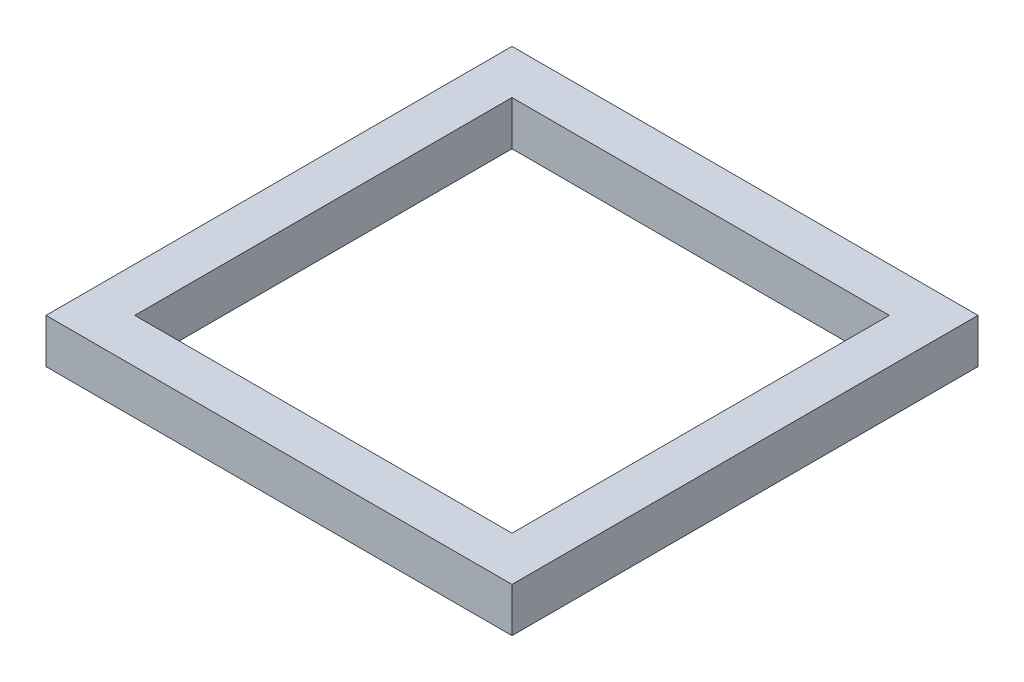
ISO-10303-21;
HEADER;
FILE_DESCRIPTION(('STEP AP214'),'2;1');
FILE_NAME('part.step','',(''),(''),'','','');
FILE_SCHEMA(('AUTOMOTIVE_DESIGN { 1 0 10303 214 1 1 1 1 }'));
ENDSEC;
DATA;
#1=APPLICATION_CONTEXT('core data for automotive mechanical design processes');
#2=APPLICATION_PROTOCOL_DEFINITION('international standard','automotive_design',2000,#1);
#3=PRODUCT_CONTEXT('',#1,'mechanical');
#4=PRODUCT('Part','Part','',(#3));
#5=PRODUCT_RELATED_PRODUCT_CATEGORY('part','',(#4));
#6=PRODUCT_DEFINITION_FORMATION('','',#4);
#7=PRODUCT_DEFINITION_CONTEXT('part definition',#1,'design');
#8=PRODUCT_DEFINITION('design','',#6,#7);
#9=PRODUCT_DEFINITION_SHAPE('','',#8);
#10=(LENGTH_UNIT() NAMED_UNIT(*) SI_UNIT(.MILLI.,.METRE.));
#11=(NAMED_UNIT(*) PLANE_ANGLE_UNIT() SI_UNIT($,.RADIAN.));
#12=(NAMED_UNIT(*) SI_UNIT($,.STERADIAN.) SOLID_ANGLE_UNIT());
#13=UNCERTAINTY_MEASURE_WITH_UNIT(LENGTH_MEASURE(1.E-05),#10,'distance_accuracy_value','');
#14=(GEOMETRIC_REPRESENTATION_CONTEXT(3) GLOBAL_UNCERTAINTY_ASSIGNED_CONTEXT((#13)) GLOBAL_UNIT_ASSIGNED_CONTEXT((#10,
#11,#12)) REPRESENTATION_CONTEXT('',''));
#15=CARTESIAN_POINT('',(0.,0.,0.));
#16=DIRECTION('',(0.,0.,1.));
#17=DIRECTION('',(1.,0.,0.));
#18=AXIS2_PLACEMENT_3D('',#15,#16,#17);
#19=CARTESIAN_POINT('',(0.,1.,0.));
#20=DIRECTION('',(1.,0.,0.));
#21=DIRECTION('',(0.,0.,-1.));
#22=AXIS2_PLACEMENT_3D('',#19,#20,#21);
#23=PLANE('',#22);
#24=DIRECTION('',(0.,0.,1.));
#25=VECTOR('',#24,1.);
#26=CARTESIAN_POINT('',(0.,0.,0.));
#27=LINE('',#26,#25);
#28=CARTESIAN_POINT('',(0.,0.,-10.5));
#29=VERTEX_POINT('',#28);
#30=CARTESIAN_POINT('',(0.,0.,0.));
#31=VERTEX_POINT('',#30);
#32=EDGE_CURVE('E147',#29,#31,#27,.T.);
#33=ORIENTED_EDGE('',*,*,#32,.T.);
#34=DIRECTION('',(0.,-1.,0.));
#35=VECTOR('',#34,1.);
#36=CARTESIAN_POINT('',(0.,1.,0.));
#37=LINE('',#36,#35);
#38=CARTESIAN_POINT('',(0.,1.,0.));
#39=VERTEX_POINT('',#38);
#40=EDGE_CURVE('E11',#39,#31,#37,.T.);
#41=ORIENTED_EDGE('',*,*,#40,.F.);
#42=DIRECTION('',(0.,0.,1.));
#43=VECTOR('',#42,1.);
#44=CARTESIAN_POINT('',(0.,1.,0.));
#45=LINE('',#44,#43);
#46=CARTESIAN_POINT('',(0.,1.,-10.5));
#47=VERTEX_POINT('',#46);
#48=EDGE_CURVE('E153',#47,#39,#45,.T.);
#49=ORIENTED_EDGE('',*,*,#48,.F.);
#50=DIRECTION('',(0.,-1.,0.));
#51=VECTOR('',#50,1.);
#52=CARTESIAN_POINT('',(0.,1.,-10.5));
#53=LINE('',#52,#51);
#54=EDGE_CURVE('E167',#47,#29,#53,.T.);
#55=ORIENTED_EDGE('',*,*,#54,.T.);
#56=EDGE_LOOP('',(#33,#41,#49,#55));
#57=FACE_BOUND('',#56,.T.);
#58=ADVANCED_FACE('F39',(#57),#23,.F.);
#59=CARTESIAN_POINT('',(0.,1.,0.));
#60=DIRECTION('',(0.,0.,-1.));
#61=DIRECTION('',(-1.,0.,0.));
#62=AXIS2_PLACEMENT_3D('',#59,#60,#61);
#63=PLANE('',#62);
#64=DIRECTION('',(1.,0.,0.));
#65=VECTOR('',#64,1.);
#66=CARTESIAN_POINT('',(0.,0.,0.));
#67=LINE('',#66,#65);
#68=CARTESIAN_POINT('',(10.5,0.,0.));
#69=VERTEX_POINT('',#68);
#70=EDGE_CURVE('E171',#31,#69,#67,.T.);
#71=ORIENTED_EDGE('',*,*,#70,.T.);
#72=DIRECTION('',(0.,-1.,0.));
#73=VECTOR('',#72,1.);
#74=CARTESIAN_POINT('',(10.5,1.,0.));
#75=LINE('',#74,#73);
#76=CARTESIAN_POINT('',(10.5,1.,0.));
#77=VERTEX_POINT('',#76);
#78=EDGE_CURVE('E47',#77,#69,#75,.T.);
#79=ORIENTED_EDGE('',*,*,#78,.F.);
#80=DIRECTION('',(1.,0.,0.));
#81=VECTOR('',#80,1.);
#82=CARTESIAN_POINT('',(0.,1.,0.));
#83=LINE('',#82,#81);
#84=EDGE_CURVE('E157',#39,#77,#83,.T.);
#85=ORIENTED_EDGE('',*,*,#84,.F.);
#86=ORIENTED_EDGE('',*,*,#40,.T.);
#87=EDGE_LOOP('',(#71,#79,#85,#86));
#88=FACE_BOUND('',#87,.T.);
#89=ADVANCED_FACE('F205',(#88),#63,.F.);
#90=CARTESIAN_POINT('',(10.5,1.,0.));
#91=DIRECTION('',(-1.,0.,0.));
#92=DIRECTION('',(0.,0.,1.));
#93=AXIS2_PLACEMENT_3D('',#90,#91,#92);
#94=PLANE('',#93);
#95=DIRECTION('',(0.,0.,-1.));
#96=VECTOR('',#95,1.);
#97=CARTESIAN_POINT('',(10.5,0.,0.));
#98=LINE('',#97,#96);
#99=CARTESIAN_POINT('',(10.5,0.,-10.5));
#100=VERTEX_POINT('',#99);
#101=EDGE_CURVE('E174',#69,#100,#98,.T.);
#102=ORIENTED_EDGE('',*,*,#101,.T.);
#103=DIRECTION('',(0.,-1.,0.));
#104=VECTOR('',#103,1.);
#105=CARTESIAN_POINT('',(10.5,1.,-10.5));
#106=LINE('',#105,#104);
#107=CARTESIAN_POINT('',(10.5,1.,-10.5));
#108=VERTEX_POINT('',#107);
#109=EDGE_CURVE('E182',#108,#100,#106,.T.);
#110=ORIENTED_EDGE('',*,*,#109,.F.);
#111=DIRECTION('',(0.,0.,-1.));
#112=VECTOR('',#111,1.);
#113=CARTESIAN_POINT('',(10.5,1.,0.));
#114=LINE('',#113,#112);
#115=EDGE_CURVE('E161',#77,#108,#114,.T.);
#116=ORIENTED_EDGE('',*,*,#115,.F.);
#117=ORIENTED_EDGE('',*,*,#78,.T.);
#118=EDGE_LOOP('',(#102,#110,#116,#117));
#119=FACE_BOUND('',#118,.T.);
#120=ADVANCED_FACE('F191',(#119),#94,.F.);
#121=CARTESIAN_POINT('',(0.,1.,-10.5));
#122=DIRECTION('',(0.,0.,1.));
#123=DIRECTION('',(1.,0.,0.));
#124=AXIS2_PLACEMENT_3D('',#121,#122,#123);
#125=PLANE('',#124);
#126=DIRECTION('',(-1.,0.,0.));
#127=VECTOR('',#126,1.);
#128=CARTESIAN_POINT('',(0.,0.,-10.5));
#129=LINE('',#128,#127);
#130=EDGE_CURVE('E158',#100,#29,#129,.T.);
#131=ORIENTED_EDGE('',*,*,#130,.T.);
#132=ORIENTED_EDGE('',*,*,#54,.F.);
#133=DIRECTION('',(-1.,0.,0.));
#134=VECTOR('',#133,1.);
#135=CARTESIAN_POINT('',(0.,1.,-10.5));
#136=LINE('',#135,#134);
#137=EDGE_CURVE('E164',#108,#47,#136,.T.);
#138=ORIENTED_EDGE('',*,*,#137,.F.);
#139=ORIENTED_EDGE('',*,*,#109,.T.);
#140=EDGE_LOOP('',(#131,#132,#138,#139));
#141=FACE_BOUND('',#140,.T.);
#142=ADVANCED_FACE('F198',(#141),#125,.F.);
#143=CARTESIAN_POINT('',(0.,1.,0.));
#144=DIRECTION('',(0.,-1.,0.));
#145=DIRECTION('',(0.,0.,-1.));
#146=AXIS2_PLACEMENT_3D('',#143,#144,#145);
#147=PLANE('',#146);
#148=DIRECTION('',(-1.,0.,0.));
#149=VECTOR('',#148,1.);
#150=CARTESIAN_POINT('',(0.999999999999999,1.,-9.5));
#151=LINE('',#150,#149);
#152=CARTESIAN_POINT('',(9.5,1.,-9.5));
#153=VERTEX_POINT('',#152);
#154=CARTESIAN_POINT('',(0.999999999999999,1.,-9.5));
#155=VERTEX_POINT('',#154);
#156=EDGE_CURVE('E138',#153,#155,#151,.T.);
#157=ORIENTED_EDGE('',*,*,#156,.F.);
#158=DIRECTION('',(0.,0.,-1.));
#159=VECTOR('',#158,1.);
#160=CARTESIAN_POINT('',(9.5,1.,-9.5));
#161=LINE('',#160,#159);
#162=CARTESIAN_POINT('',(9.5,1.,-1.));
#163=VERTEX_POINT('',#162);
#164=EDGE_CURVE('E54',#163,#153,#161,.T.);
#165=ORIENTED_EDGE('',*,*,#164,.F.);
#166=DIRECTION('',(1.,0.,0.));
#167=VECTOR('',#166,1.);
#168=CARTESIAN_POINT('',(1.,1.,-1.));
#169=LINE('',#168,#167);
#170=CARTESIAN_POINT('',(1.,1.,-1.));
#171=VERTEX_POINT('',#170);
#172=EDGE_CURVE('E125',#171,#163,#169,.T.);
#173=ORIENTED_EDGE('',*,*,#172,.F.);
#174=DIRECTION('',(0.,0.,1.));
#175=VECTOR('',#174,1.);
#176=CARTESIAN_POINT('',(0.999999999999999,1.,-9.5));
#177=LINE('',#176,#175);
#178=EDGE_CURVE('E129',#155,#171,#177,.T.);
#179=ORIENTED_EDGE('',*,*,#178,.F.);
#180=EDGE_LOOP('',(#157,#165,#173,#179));
#181=FACE_BOUND('',#180,.T.);
#182=ORIENTED_EDGE('',*,*,#48,.T.);
#183=ORIENTED_EDGE('',*,*,#84,.T.);
#184=ORIENTED_EDGE('',*,*,#115,.T.);
#185=ORIENTED_EDGE('',*,*,#137,.T.);
#186=EDGE_LOOP('',(#182,#183,#184,#185));
#187=FACE_BOUND('',#186,.T.);
#188=ADVANCED_FACE('F204',(#181,#187),#147,.F.);
#189=CARTESIAN_POINT('',(0.,0.,0.));
#190=DIRECTION('',(0.,-1.,0.));
#191=DIRECTION('',(0.,0.,-1.));
#192=AXIS2_PLACEMENT_3D('',#189,#190,#191);
#193=PLANE('',#192);
#194=DIRECTION('',(0.,0.,-1.));
#195=VECTOR('',#194,1.);
#196=CARTESIAN_POINT('',(9.5,0.,-9.5));
#197=LINE('',#196,#195);
#198=CARTESIAN_POINT('',(9.5,0.,-1.));
#199=VERTEX_POINT('',#198);
#200=CARTESIAN_POINT('',(9.5,0.,-9.5));
#201=VERTEX_POINT('',#200);
#202=EDGE_CURVE('E106',#199,#201,#197,.T.);
#203=ORIENTED_EDGE('',*,*,#202,.T.);
#204=DIRECTION('',(-1.,0.,0.));
#205=VECTOR('',#204,1.);
#206=CARTESIAN_POINT('',(0.999999999999999,0.,-9.5));
#207=LINE('',#206,#205);
#208=CARTESIAN_POINT('',(0.999999999999999,0.,-9.5));
#209=VERTEX_POINT('',#208);
#210=EDGE_CURVE('E116',#201,#209,#207,.T.);
#211=ORIENTED_EDGE('',*,*,#210,.T.);
#212=DIRECTION('',(0.,0.,1.));
#213=VECTOR('',#212,1.);
#214=CARTESIAN_POINT('',(0.999999999999999,0.,-9.5));
#215=LINE('',#214,#213);
#216=CARTESIAN_POINT('',(1.,0.,-1.));
#217=VERTEX_POINT('',#216);
#218=EDGE_CURVE('E62',#209,#217,#215,.T.);
#219=ORIENTED_EDGE('',*,*,#218,.T.);
#220=DIRECTION('',(1.,0.,0.));
#221=VECTOR('',#220,1.);
#222=CARTESIAN_POINT('',(1.,0.,-1.));
#223=LINE('',#222,#221);
#224=EDGE_CURVE('E113',#217,#199,#223,.T.);
#225=ORIENTED_EDGE('',*,*,#224,.T.);
#226=EDGE_LOOP('',(#203,#211,#219,#225));
#227=FACE_BOUND('',#226,.T.);
#228=ORIENTED_EDGE('',*,*,#32,.F.);
#229=ORIENTED_EDGE('',*,*,#130,.F.);
#230=ORIENTED_EDGE('',*,*,#101,.F.);
#231=ORIENTED_EDGE('',*,*,#70,.F.);
#232=EDGE_LOOP('',(#228,#229,#230,#231));
#233=FACE_BOUND('',#232,.T.);
#234=ADVANCED_FACE('F121',(#227,#233),#193,.T.);
#235=CARTESIAN_POINT('',(9.5,0.,-9.5));
#236=DIRECTION('',(1.,0.,0.));
#237=DIRECTION('',(0.,0.,-1.));
#238=AXIS2_PLACEMENT_3D('',#235,#236,#237);
#239=PLANE('',#238);
#240=ORIENTED_EDGE('',*,*,#164,.T.);
#241=DIRECTION('',(0.,1.,0.));
#242=VECTOR('',#241,1.);
#243=CARTESIAN_POINT('',(9.5,0.,-9.5));
#244=LINE('',#243,#242);
#245=EDGE_CURVE('E102',#201,#153,#244,.T.);
#246=ORIENTED_EDGE('',*,*,#245,.F.);
#247=ORIENTED_EDGE('',*,*,#202,.F.);
#248=DIRECTION('',(0.,1.,0.));
#249=VECTOR('',#248,1.);
#250=CARTESIAN_POINT('',(9.5,0.,-1.));
#251=LINE('',#250,#249);
#252=EDGE_CURVE('E144',#199,#163,#251,.T.);
#253=ORIENTED_EDGE('',*,*,#252,.T.);
#254=EDGE_LOOP('',(#240,#246,#247,#253));
#255=FACE_BOUND('',#254,.T.);
#256=ADVANCED_FACE('F104',(#255),#239,.F.);
#257=CARTESIAN_POINT('',(1.,0.,-1.));
#258=DIRECTION('',(0.,0.,1.));
#259=DIRECTION('',(1.,0.,0.));
#260=AXIS2_PLACEMENT_3D('',#257,#258,#259);
#261=PLANE('',#260);
#262=ORIENTED_EDGE('',*,*,#172,.T.);
#263=ORIENTED_EDGE('',*,*,#252,.F.);
#264=ORIENTED_EDGE('',*,*,#224,.F.);
#265=DIRECTION('',(0.,1.,0.));
#266=VECTOR('',#265,1.);
#267=CARTESIAN_POINT('',(1.,0.,-1.));
#268=LINE('',#267,#266);
#269=EDGE_CURVE('E148',#217,#171,#268,.T.);
#270=ORIENTED_EDGE('',*,*,#269,.T.);
#271=EDGE_LOOP('',(#262,#263,#264,#270));
#272=FACE_BOUND('',#271,.T.);
#273=ADVANCED_FACE('F222',(#272),#261,.F.);
#274=CARTESIAN_POINT('',(0.999999999999999,0.,-9.5));
#275=DIRECTION('',(-1.,0.,0.));
#276=DIRECTION('',(0.,0.,1.));
#277=AXIS2_PLACEMENT_3D('',#274,#275,#276);
#278=PLANE('',#277);
#279=ORIENTED_EDGE('',*,*,#178,.T.);
#280=ORIENTED_EDGE('',*,*,#269,.F.);
#281=ORIENTED_EDGE('',*,*,#218,.F.);
#282=DIRECTION('',(0.,1.,0.));
#283=VECTOR('',#282,1.);
#284=CARTESIAN_POINT('',(0.999999999999999,0.,-9.5));
#285=LINE('',#284,#283);
#286=EDGE_CURVE('E112',#209,#155,#285,.T.);
#287=ORIENTED_EDGE('',*,*,#286,.T.);
#288=EDGE_LOOP('',(#279,#280,#281,#287));
#289=FACE_BOUND('',#288,.T.);
#290=ADVANCED_FACE('F225',(#289),#278,.F.);
#291=CARTESIAN_POINT('',(0.999999999999999,0.,-9.5));
#292=DIRECTION('',(0.,0.,-1.));
#293=DIRECTION('',(-1.,0.,0.));
#294=AXIS2_PLACEMENT_3D('',#291,#292,#293);
#295=PLANE('',#294);
#296=ORIENTED_EDGE('',*,*,#156,.T.);
#297=ORIENTED_EDGE('',*,*,#286,.F.);
#298=ORIENTED_EDGE('',*,*,#210,.F.);
#299=ORIENTED_EDGE('',*,*,#245,.T.);
#300=EDGE_LOOP('',(#296,#297,#298,#299));
#301=FACE_BOUND('',#300,.T.);
#302=ADVANCED_FACE('F117',(#301),#295,.F.);
#303=CLOSED_SHELL('',(#58,#89,#120,#142,#188,#234,#256,#273,#290,#302));
#304=MANIFOLD_SOLID_BREP('B2',#303);
#305=ADVANCED_BREP_SHAPE_REPRESENTATION('',(#18,#304),#14);
#306=SHAPE_DEFINITION_REPRESENTATION(#9,#305);
ENDSEC;
END-ISO-10303-21;
